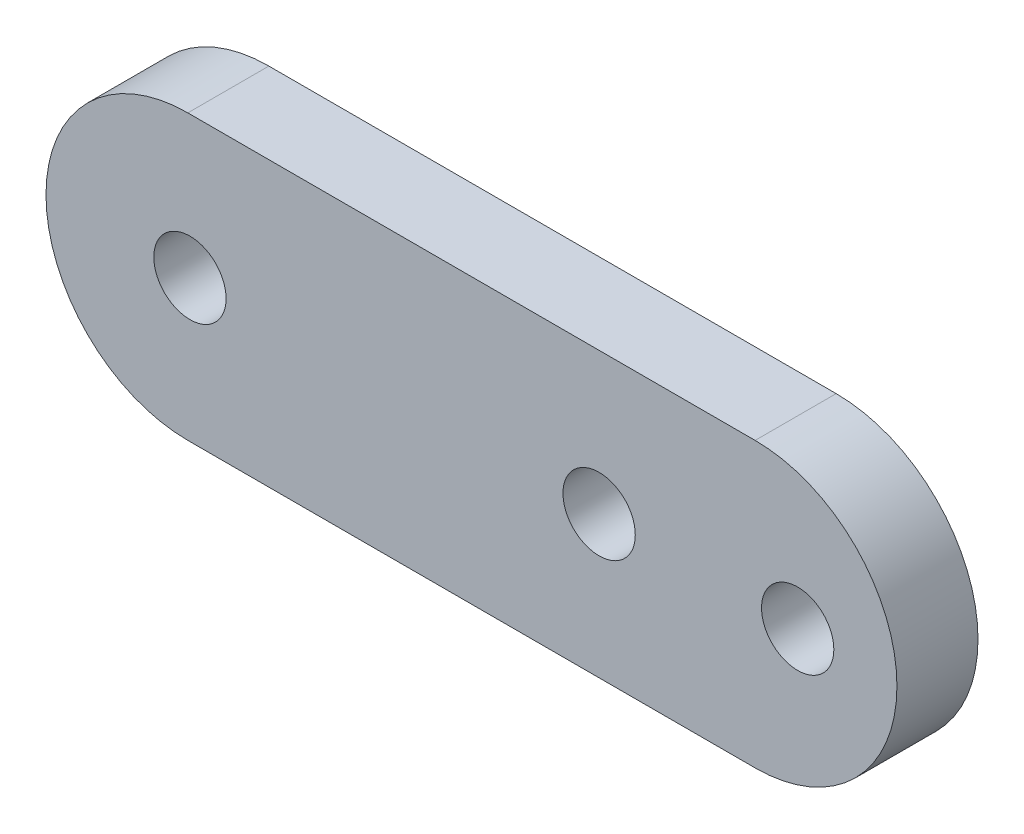
ISO-10303-21;
HEADER;
FILE_DESCRIPTION(('STEP AP214'),'2;1');
FILE_NAME('part.step','',(''),(''),'','','');
FILE_SCHEMA(('AUTOMOTIVE_DESIGN { 1 0 10303 214 1 1 1 1 }'));
ENDSEC;
DATA;
#1=APPLICATION_CONTEXT('core data for automotive mechanical design processes');
#2=APPLICATION_PROTOCOL_DEFINITION('international standard','automotive_design',2000,#1);
#3=PRODUCT_CONTEXT('',#1,'mechanical');
#4=PRODUCT('Part','Part','',(#3));
#5=PRODUCT_RELATED_PRODUCT_CATEGORY('part','',(#4));
#6=PRODUCT_DEFINITION_FORMATION('','',#4);
#7=PRODUCT_DEFINITION_CONTEXT('part definition',#1,'design');
#8=PRODUCT_DEFINITION('design','',#6,#7);
#9=PRODUCT_DEFINITION_SHAPE('','',#8);
#10=(LENGTH_UNIT() NAMED_UNIT(*) SI_UNIT(.MILLI.,.METRE.));
#11=(NAMED_UNIT(*) PLANE_ANGLE_UNIT() SI_UNIT($,.RADIAN.));
#12=(NAMED_UNIT(*) SI_UNIT($,.STERADIAN.) SOLID_ANGLE_UNIT());
#13=UNCERTAINTY_MEASURE_WITH_UNIT(LENGTH_MEASURE(1.E-05),#10,'distance_accuracy_value','');
#14=(GEOMETRIC_REPRESENTATION_CONTEXT(3) GLOBAL_UNCERTAINTY_ASSIGNED_CONTEXT((#13)) GLOBAL_UNIT_ASSIGNED_CONTEXT((#10,
#11,#12)) REPRESENTATION_CONTEXT('',''));
#15=CARTESIAN_POINT('',(0.,0.,0.));
#16=DIRECTION('',(0.,0.,1.));
#17=DIRECTION('',(1.,0.,0.));
#18=AXIS2_PLACEMENT_3D('',#15,#16,#17);
#19=CARTESIAN_POINT('',(-20.,0.,2.8575));
#20=DIRECTION('',(0.,0.,-1.));
#21=DIRECTION('',(-1.,0.,0.));
#22=AXIS2_PLACEMENT_3D('',#19,#20,#21);
#23=CYLINDRICAL_SURFACE('',#22,10.);
#24=CARTESIAN_POINT('',(-20.,0.,-2.8575));
#25=DIRECTION('',(0.,0.,1.));
#26=DIRECTION('',(1.,0.,0.));
#27=AXIS2_PLACEMENT_3D('',#24,#25,#26);
#28=CIRCLE('',#27,10.);
#29=CARTESIAN_POINT('',(-20.,10.,-2.8575));
#30=VERTEX_POINT('',#29);
#31=CARTESIAN_POINT('',(-20.,-10.,-2.8575));
#32=VERTEX_POINT('',#31);
#33=EDGE_CURVE('E95',#30,#32,#28,.T.);
#34=ORIENTED_EDGE('',*,*,#33,.T.);
#35=DIRECTION('',(0.,0.,-1.));
#36=VECTOR('',#35,1.);
#37=CARTESIAN_POINT('',(-20.,-10.,2.8575));
#38=LINE('',#37,#36);
#39=CARTESIAN_POINT('',(-20.,-10.,2.8575));
#40=VERTEX_POINT('',#39);
#41=EDGE_CURVE('E11',#40,#32,#38,.T.);
#42=ORIENTED_EDGE('',*,*,#41,.F.);
#43=CARTESIAN_POINT('',(-20.,0.,2.8575));
#44=DIRECTION('',(0.,0.,1.));
#45=DIRECTION('',(1.,0.,0.));
#46=AXIS2_PLACEMENT_3D('',#43,#44,#45);
#47=CIRCLE('',#46,10.);
#48=CARTESIAN_POINT('',(-20.,10.,2.8575));
#49=VERTEX_POINT('',#48);
#50=EDGE_CURVE('E83',#49,#40,#47,.T.);
#51=ORIENTED_EDGE('',*,*,#50,.F.);
#52=DIRECTION('',(0.,0.,-1.));
#53=VECTOR('',#52,1.);
#54=CARTESIAN_POINT('',(-20.,10.,2.8575));
#55=LINE('',#54,#53);
#56=EDGE_CURVE('E91',#49,#30,#55,.T.);
#57=ORIENTED_EDGE('',*,*,#56,.T.);
#58=EDGE_LOOP('',(#34,#42,#51,#57));
#59=FACE_BOUND('',#58,.T.);
#60=ADVANCED_FACE('F32',(#59),#23,.T.);
#61=CARTESIAN_POINT('',(-20.,-10.,2.8575));
#62=DIRECTION('',(0.,1.,0.));
#63=DIRECTION('',(0.,0.,1.));
#64=AXIS2_PLACEMENT_3D('',#61,#62,#63);
#65=PLANE('',#64);
#66=DIRECTION('',(1.,0.,0.));
#67=VECTOR('',#66,1.);
#68=CARTESIAN_POINT('',(-20.,-10.,-2.8575));
#69=LINE('',#68,#67);
#70=CARTESIAN_POINT('',(20.,-10.,-2.8575));
#71=VERTEX_POINT('',#70);
#72=EDGE_CURVE('E87',#32,#71,#69,.T.);
#73=ORIENTED_EDGE('',*,*,#72,.T.);
#74=DIRECTION('',(0.,0.,-1.));
#75=VECTOR('',#74,1.);
#76=CARTESIAN_POINT('',(20.,-10.,2.8575));
#77=LINE('',#76,#75);
#78=CARTESIAN_POINT('',(20.,-10.,2.8575));
#79=VERTEX_POINT('',#78);
#80=EDGE_CURVE('E40',#79,#71,#77,.T.);
#81=ORIENTED_EDGE('',*,*,#80,.F.);
#82=DIRECTION('',(1.,0.,0.));
#83=VECTOR('',#82,1.);
#84=CARTESIAN_POINT('',(-20.,-10.,2.8575));
#85=LINE('',#84,#83);
#86=EDGE_CURVE('E78',#40,#79,#85,.T.);
#87=ORIENTED_EDGE('',*,*,#86,.F.);
#88=ORIENTED_EDGE('',*,*,#41,.T.);
#89=EDGE_LOOP('',(#73,#81,#87,#88));
#90=FACE_BOUND('',#89,.T.);
#91=ADVANCED_FACE('F86',(#90),#65,.F.);
#92=CARTESIAN_POINT('',(20.,0.,2.8575));
#93=DIRECTION('',(0.,0.,-1.));
#94=DIRECTION('',(-1.,0.,0.));
#95=AXIS2_PLACEMENT_3D('',#92,#93,#94);
#96=CYLINDRICAL_SURFACE('',#95,10.);
#97=CARTESIAN_POINT('',(20.,0.,-2.8575));
#98=DIRECTION('',(0.,0.,1.));
#99=DIRECTION('',(1.,0.,0.));
#100=AXIS2_PLACEMENT_3D('',#97,#98,#99);
#101=CIRCLE('',#100,10.);
#102=CARTESIAN_POINT('',(20.,10.,-2.8575));
#103=VERTEX_POINT('',#102);
#104=EDGE_CURVE('E65',#71,#103,#101,.T.);
#105=ORIENTED_EDGE('',*,*,#104,.T.);
#106=DIRECTION('',(0.,0.,-1.));
#107=VECTOR('',#106,1.);
#108=CARTESIAN_POINT('',(20.,10.,2.8575));
#109=LINE('',#108,#107);
#110=CARTESIAN_POINT('',(20.,10.,2.8575));
#111=VERTEX_POINT('',#110);
#112=EDGE_CURVE('E88',#111,#103,#109,.T.);
#113=ORIENTED_EDGE('',*,*,#112,.F.);
#114=CARTESIAN_POINT('',(20.,0.,2.8575));
#115=DIRECTION('',(0.,0.,1.));
#116=DIRECTION('',(1.,0.,0.));
#117=AXIS2_PLACEMENT_3D('',#114,#115,#116);
#118=CIRCLE('',#117,10.);
#119=EDGE_CURVE('E81',#79,#111,#118,.T.);
#120=ORIENTED_EDGE('',*,*,#119,.F.);
#121=ORIENTED_EDGE('',*,*,#80,.T.);
#122=EDGE_LOOP('',(#105,#113,#120,#121));
#123=FACE_BOUND('',#122,.T.);
#124=ADVANCED_FACE('F89',(#123),#96,.T.);
#125=CARTESIAN_POINT('',(-20.,10.,2.8575));
#126=DIRECTION('',(0.,-1.,0.));
#127=DIRECTION('',(0.,0.,-1.));
#128=AXIS2_PLACEMENT_3D('',#125,#126,#127);
#129=PLANE('',#128);
#130=DIRECTION('',(-1.,0.,0.));
#131=VECTOR('',#130,1.);
#132=CARTESIAN_POINT('',(-20.,10.,-2.8575));
#133=LINE('',#132,#131);
#134=EDGE_CURVE('E71',#103,#30,#133,.T.);
#135=ORIENTED_EDGE('',*,*,#134,.T.);
#136=ORIENTED_EDGE('',*,*,#56,.F.);
#137=DIRECTION('',(-1.,0.,0.));
#138=VECTOR('',#137,1.);
#139=CARTESIAN_POINT('',(-20.,10.,2.8575));
#140=LINE('',#139,#138);
#141=EDGE_CURVE('E48',#111,#49,#140,.T.);
#142=ORIENTED_EDGE('',*,*,#141,.F.);
#143=ORIENTED_EDGE('',*,*,#112,.T.);
#144=EDGE_LOOP('',(#135,#136,#142,#143));
#145=FACE_BOUND('',#144,.T.);
#146=ADVANCED_FACE('F103',(#145),#129,.F.);
#147=CARTESIAN_POINT('',(-20.,0.,2.8575));
#148=DIRECTION('',(0.,0.,1.));
#149=DIRECTION('',(1.,0.,0.));
#150=AXIS2_PLACEMENT_3D('',#147,#148,#149);
#151=PLANE('',#150);
#152=CARTESIAN_POINT('',(-19.85,0.,2.8575));
#153=DIRECTION('',(0.,0.,1.));
#154=DIRECTION('',(1.,0.,0.));
#155=AXIS2_PLACEMENT_3D('',#152,#153,#154);
#156=CIRCLE('',#155,2.55);
#157=CARTESIAN_POINT('',(-17.3,0.,2.8575));
#158=VERTEX_POINT('',#157);
#159=EDGE_CURVE('E123',#158,#158,#156,.T.);
#160=ORIENTED_EDGE('',*,*,#159,.F.);
#161=EDGE_LOOP('',(#160));
#162=FACE_BOUND('',#161,.T.);
#163=CARTESIAN_POINT('',(9.,0.,2.8575));
#164=DIRECTION('',(0.,0.,1.));
#165=DIRECTION('',(1.,0.,0.));
#166=AXIS2_PLACEMENT_3D('',#163,#164,#165);
#167=CIRCLE('',#166,2.55);
#168=CARTESIAN_POINT('',(11.55,0.,2.8575));
#169=VERTEX_POINT('',#168);
#170=EDGE_CURVE('E116',#169,#169,#167,.T.);
#171=ORIENTED_EDGE('',*,*,#170,.F.);
#172=EDGE_LOOP('',(#171));
#173=FACE_BOUND('',#172,.T.);
#174=CARTESIAN_POINT('',(23.,0.,2.8575));
#175=DIRECTION('',(0.,0.,1.));
#176=DIRECTION('',(1.,0.,0.));
#177=AXIS2_PLACEMENT_3D('',#174,#175,#176);
#178=CIRCLE('',#177,2.55);
#179=CARTESIAN_POINT('',(25.55,0.,2.8575));
#180=VERTEX_POINT('',#179);
#181=EDGE_CURVE('E109',#180,#180,#178,.T.);
#182=ORIENTED_EDGE('',*,*,#181,.F.);
#183=EDGE_LOOP('',(#182));
#184=FACE_BOUND('',#183,.T.);
#185=ORIENTED_EDGE('',*,*,#50,.T.);
#186=ORIENTED_EDGE('',*,*,#86,.T.);
#187=ORIENTED_EDGE('',*,*,#119,.T.);
#188=ORIENTED_EDGE('',*,*,#141,.T.);
#189=EDGE_LOOP('',(#185,#186,#187,#188));
#190=FACE_BOUND('',#189,.T.);
#191=ADVANCED_FACE('F79',(#162,#173,#184,#190),#151,.T.);
#192=CARTESIAN_POINT('',(-20.,0.,-2.8575));
#193=DIRECTION('',(0.,0.,1.));
#194=DIRECTION('',(1.,0.,0.));
#195=AXIS2_PLACEMENT_3D('',#192,#193,#194);
#196=PLANE('',#195);
#197=CARTESIAN_POINT('',(-19.85,0.,-2.8575));
#198=DIRECTION('',(0.,0.,1.));
#199=DIRECTION('',(1.,0.,0.));
#200=AXIS2_PLACEMENT_3D('',#197,#198,#199);
#201=CIRCLE('',#200,2.55);
#202=CARTESIAN_POINT('',(-17.3,0.,-2.8575));
#203=VERTEX_POINT('',#202);
#204=EDGE_CURVE('E113',#203,#203,#201,.F.);
#205=ORIENTED_EDGE('',*,*,#204,.F.);
#206=EDGE_LOOP('',(#205));
#207=FACE_BOUND('',#206,.T.);
#208=CARTESIAN_POINT('',(9.,0.,-2.8575));
#209=DIRECTION('',(0.,0.,1.));
#210=DIRECTION('',(1.,0.,0.));
#211=AXIS2_PLACEMENT_3D('',#208,#209,#210);
#212=CIRCLE('',#211,2.55);
#213=CARTESIAN_POINT('',(11.55,0.,-2.8575));
#214=VERTEX_POINT('',#213);
#215=EDGE_CURVE('E98',#214,#214,#212,.T.);
#216=ORIENTED_EDGE('',*,*,#215,.T.);
#217=EDGE_LOOP('',(#216));
#218=FACE_BOUND('',#217,.T.);
#219=CARTESIAN_POINT('',(23.,0.,-2.8575));
#220=DIRECTION('',(0.,0.,1.));
#221=DIRECTION('',(1.,0.,0.));
#222=AXIS2_PLACEMENT_3D('',#219,#220,#221);
#223=CIRCLE('',#222,2.55);
#224=CARTESIAN_POINT('',(25.55,0.,-2.8575));
#225=VERTEX_POINT('',#224);
#226=EDGE_CURVE('E112',#225,#225,#223,.T.);
#227=ORIENTED_EDGE('',*,*,#226,.T.);
#228=EDGE_LOOP('',(#227));
#229=FACE_BOUND('',#228,.T.);
#230=ORIENTED_EDGE('',*,*,#33,.F.);
#231=ORIENTED_EDGE('',*,*,#134,.F.);
#232=ORIENTED_EDGE('',*,*,#104,.F.);
#233=ORIENTED_EDGE('',*,*,#72,.F.);
#234=EDGE_LOOP('',(#230,#231,#232,#233));
#235=FACE_BOUND('',#234,.T.);
#236=ADVANCED_FACE('F106',(#207,#218,#229,#235),#196,.F.);
#237=CARTESIAN_POINT('',(23.,0.,-2.8575));
#238=DIRECTION('',(0.,0.,1.));
#239=DIRECTION('',(1.,0.,0.));
#240=AXIS2_PLACEMENT_3D('',#237,#238,#239);
#241=CYLINDRICAL_SURFACE('',#240,2.55);
#242=ORIENTED_EDGE('',*,*,#226,.F.);
#243=EDGE_LOOP('',(#242));
#244=FACE_BOUND('',#243,.T.);
#245=ORIENTED_EDGE('',*,*,#181,.T.);
#246=EDGE_LOOP('',(#245));
#247=FACE_BOUND('',#246,.T.);
#248=ADVANCED_FACE('F136',(#244,#247),#241,.F.);
#249=CARTESIAN_POINT('',(9.,0.,-2.8575));
#250=DIRECTION('',(0.,0.,1.));
#251=DIRECTION('',(1.,0.,0.));
#252=AXIS2_PLACEMENT_3D('',#249,#250,#251);
#253=CYLINDRICAL_SURFACE('',#252,2.55);
#254=ORIENTED_EDGE('',*,*,#215,.F.);
#255=EDGE_LOOP('',(#254));
#256=FACE_BOUND('',#255,.T.);
#257=ORIENTED_EDGE('',*,*,#170,.T.);
#258=EDGE_LOOP('',(#257));
#259=FACE_BOUND('',#258,.T.);
#260=ADVANCED_FACE('F138',(#256,#259),#253,.F.);
#261=CARTESIAN_POINT('',(-19.85,0.,-10.0699891681028));
#262=DIRECTION('',(0.,0.,1.));
#263=DIRECTION('',(1.,0.,0.));
#264=AXIS2_PLACEMENT_3D('',#261,#262,#263);
#265=CYLINDRICAL_SURFACE('',#264,2.55);
#266=ORIENTED_EDGE('',*,*,#204,.T.);
#267=EDGE_LOOP('',(#266));
#268=FACE_BOUND('',#267,.T.);
#269=ORIENTED_EDGE('',*,*,#159,.T.);
#270=EDGE_LOOP('',(#269));
#271=FACE_BOUND('',#270,.T.);
#272=ADVANCED_FACE('F127',(#268,#271),#265,.F.);
#273=CLOSED_SHELL('',(#60,#91,#124,#146,#191,#236,#248,#260,#272));
#274=MANIFOLD_SOLID_BREP('B2',#273);
#275=ADVANCED_BREP_SHAPE_REPRESENTATION('',(#18,#274),#14);
#276=SHAPE_DEFINITION_REPRESENTATION(#9,#275);
ENDSEC;
END-ISO-10303-21;
